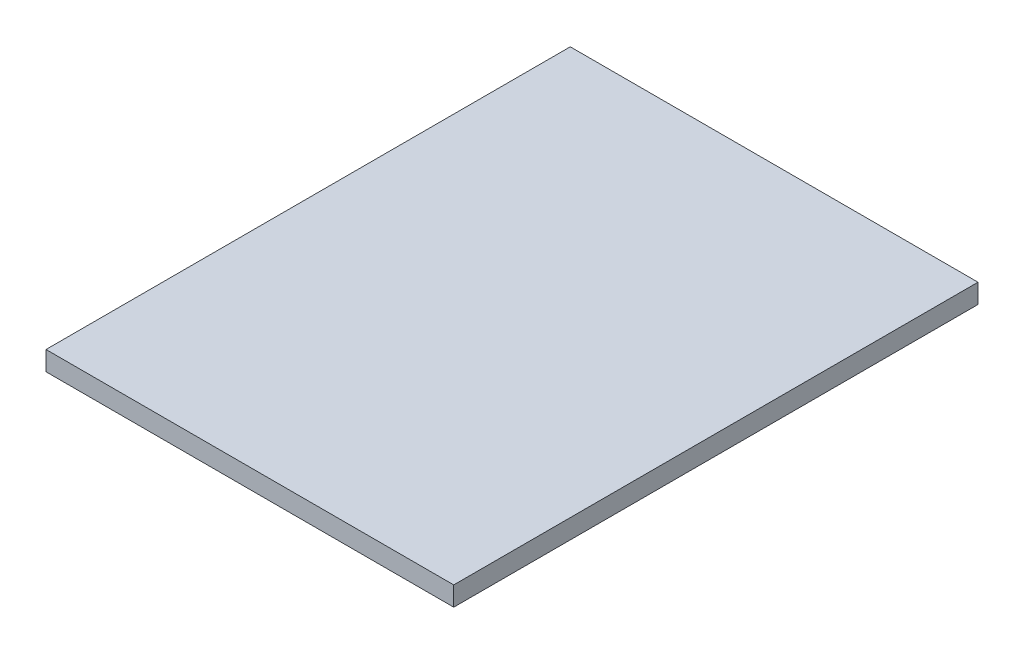
ISO-10303-21;
HEADER;
FILE_DESCRIPTION(('STEP AP214'),'2;1');
FILE_NAME('part.step','',(''),(''),'','','');
FILE_SCHEMA(('AUTOMOTIVE_DESIGN { 1 0 10303 214 1 1 1 1 }'));
ENDSEC;
DATA;
#1=APPLICATION_CONTEXT('core data for automotive mechanical design processes');
#2=APPLICATION_PROTOCOL_DEFINITION('international standard','automotive_design',2000,#1);
#3=PRODUCT_CONTEXT('',#1,'mechanical');
#4=PRODUCT('Part','Part','',(#3));
#5=PRODUCT_RELATED_PRODUCT_CATEGORY('part','',(#4));
#6=PRODUCT_DEFINITION_FORMATION('','',#4);
#7=PRODUCT_DEFINITION_CONTEXT('part definition',#1,'design');
#8=PRODUCT_DEFINITION('design','',#6,#7);
#9=PRODUCT_DEFINITION_SHAPE('','',#8);
#10=(LENGTH_UNIT() NAMED_UNIT(*) SI_UNIT(.MILLI.,.METRE.));
#11=(NAMED_UNIT(*) PLANE_ANGLE_UNIT() SI_UNIT($,.RADIAN.));
#12=(NAMED_UNIT(*) SI_UNIT($,.STERADIAN.) SOLID_ANGLE_UNIT());
#13=UNCERTAINTY_MEASURE_WITH_UNIT(LENGTH_MEASURE(1.E-05),#10,'distance_accuracy_value','');
#14=(GEOMETRIC_REPRESENTATION_CONTEXT(3) GLOBAL_UNCERTAINTY_ASSIGNED_CONTEXT((#13)) GLOBAL_UNIT_ASSIGNED_CONTEXT((#10,
#11,#12)) REPRESENTATION_CONTEXT('',''));
#15=CARTESIAN_POINT('',(0.,0.,0.));
#16=DIRECTION('',(0.,0.,1.));
#17=DIRECTION('',(1.,0.,0.));
#18=AXIS2_PLACEMENT_3D('',#15,#16,#17);
#19=CARTESIAN_POINT('',(0.,2.54,0.));
#20=DIRECTION('',(1.,0.,0.));
#21=DIRECTION('',(0.,0.,-1.));
#22=AXIS2_PLACEMENT_3D('',#19,#20,#21);
#23=PLANE('',#22);
#24=DIRECTION('',(0.,0.,1.));
#25=VECTOR('',#24,1.);
#26=CARTESIAN_POINT('',(0.,0.,0.));
#27=LINE('',#26,#25);
#28=CARTESIAN_POINT('',(0.,0.,-68.9102));
#29=VERTEX_POINT('',#28);
#30=CARTESIAN_POINT('',(0.,0.,0.));
#31=VERTEX_POINT('',#30);
#32=EDGE_CURVE('E96',#29,#31,#27,.T.);
#33=ORIENTED_EDGE('',*,*,#32,.T.);
#34=DIRECTION('',(0.,-1.,0.));
#35=VECTOR('',#34,1.);
#36=CARTESIAN_POINT('',(0.,2.54,0.));
#37=LINE('',#36,#35);
#38=CARTESIAN_POINT('',(0.,2.54,0.));
#39=VERTEX_POINT('',#38);
#40=EDGE_CURVE('E11',#39,#31,#37,.T.);
#41=ORIENTED_EDGE('',*,*,#40,.F.);
#42=DIRECTION('',(0.,0.,1.));
#43=VECTOR('',#42,1.);
#44=CARTESIAN_POINT('',(0.,2.54,0.));
#45=LINE('',#44,#43);
#46=CARTESIAN_POINT('',(0.,2.54,-68.9102));
#47=VERTEX_POINT('',#46);
#48=EDGE_CURVE('E84',#47,#39,#45,.T.);
#49=ORIENTED_EDGE('',*,*,#48,.F.);
#50=DIRECTION('',(0.,-1.,0.));
#51=VECTOR('',#50,1.);
#52=CARTESIAN_POINT('',(0.,2.54,-68.9102));
#53=LINE('',#52,#51);
#54=EDGE_CURVE('E92',#47,#29,#53,.T.);
#55=ORIENTED_EDGE('',*,*,#54,.T.);
#56=EDGE_LOOP('',(#33,#41,#49,#55));
#57=FACE_BOUND('',#56,.T.);
#58=ADVANCED_FACE('F33',(#57),#23,.F.);
#59=CARTESIAN_POINT('',(0.,2.54,0.));
#60=DIRECTION('',(0.,0.,-1.));
#61=DIRECTION('',(-1.,0.,0.));
#62=AXIS2_PLACEMENT_3D('',#59,#60,#61);
#63=PLANE('',#62);
#64=DIRECTION('',(1.,0.,0.));
#65=VECTOR('',#64,1.);
#66=CARTESIAN_POINT('',(0.,0.,0.));
#67=LINE('',#66,#65);
#68=CARTESIAN_POINT('',(53.594,0.,0.));
#69=VERTEX_POINT('',#68);
#70=EDGE_CURVE('E88',#31,#69,#67,.T.);
#71=ORIENTED_EDGE('',*,*,#70,.T.);
#72=DIRECTION('',(0.,-1.,0.));
#73=VECTOR('',#72,1.);
#74=CARTESIAN_POINT('',(53.594,2.54,0.));
#75=LINE('',#74,#73);
#76=CARTESIAN_POINT('',(53.594,2.54,0.));
#77=VERTEX_POINT('',#76);
#78=EDGE_CURVE('E41',#77,#69,#75,.T.);
#79=ORIENTED_EDGE('',*,*,#78,.F.);
#80=DIRECTION('',(1.,0.,0.));
#81=VECTOR('',#80,1.);
#82=CARTESIAN_POINT('',(0.,2.54,0.));
#83=LINE('',#82,#81);
#84=EDGE_CURVE('E79',#39,#77,#83,.T.);
#85=ORIENTED_EDGE('',*,*,#84,.F.);
#86=ORIENTED_EDGE('',*,*,#40,.T.);
#87=EDGE_LOOP('',(#71,#79,#85,#86));
#88=FACE_BOUND('',#87,.T.);
#89=ADVANCED_FACE('F87',(#88),#63,.F.);
#90=CARTESIAN_POINT('',(53.594,2.54,0.));
#91=DIRECTION('',(-1.,0.,0.));
#92=DIRECTION('',(0.,0.,1.));
#93=AXIS2_PLACEMENT_3D('',#90,#91,#92);
#94=PLANE('',#93);
#95=DIRECTION('',(0.,0.,-1.));
#96=VECTOR('',#95,1.);
#97=CARTESIAN_POINT('',(53.594,0.,0.));
#98=LINE('',#97,#96);
#99=CARTESIAN_POINT('',(53.594,0.,-68.9102));
#100=VERTEX_POINT('',#99);
#101=EDGE_CURVE('E66',#69,#100,#98,.T.);
#102=ORIENTED_EDGE('',*,*,#101,.T.);
#103=DIRECTION('',(0.,-1.,0.));
#104=VECTOR('',#103,1.);
#105=CARTESIAN_POINT('',(53.594,2.54,-68.9102));
#106=LINE('',#105,#104);
#107=CARTESIAN_POINT('',(53.594,2.54,-68.9102));
#108=VERTEX_POINT('',#107);
#109=EDGE_CURVE('E89',#108,#100,#106,.T.);
#110=ORIENTED_EDGE('',*,*,#109,.F.);
#111=DIRECTION('',(0.,0.,-1.));
#112=VECTOR('',#111,1.);
#113=CARTESIAN_POINT('',(53.594,2.54,0.));
#114=LINE('',#113,#112);
#115=EDGE_CURVE('E82',#77,#108,#114,.T.);
#116=ORIENTED_EDGE('',*,*,#115,.F.);
#117=ORIENTED_EDGE('',*,*,#78,.T.);
#118=EDGE_LOOP('',(#102,#110,#116,#117));
#119=FACE_BOUND('',#118,.T.);
#120=ADVANCED_FACE('F90',(#119),#94,.F.);
#121=CARTESIAN_POINT('',(0.,2.54,-68.9102));
#122=DIRECTION('',(0.,0.,1.));
#123=DIRECTION('',(1.,0.,0.));
#124=AXIS2_PLACEMENT_3D('',#121,#122,#123);
#125=PLANE('',#124);
#126=DIRECTION('',(-1.,0.,0.));
#127=VECTOR('',#126,1.);
#128=CARTESIAN_POINT('',(0.,0.,-68.9102));
#129=LINE('',#128,#127);
#130=EDGE_CURVE('E72',#100,#29,#129,.T.);
#131=ORIENTED_EDGE('',*,*,#130,.T.);
#132=ORIENTED_EDGE('',*,*,#54,.F.);
#133=DIRECTION('',(-1.,0.,0.));
#134=VECTOR('',#133,1.);
#135=CARTESIAN_POINT('',(0.,2.54,-68.9102));
#136=LINE('',#135,#134);
#137=EDGE_CURVE('E49',#108,#47,#136,.T.);
#138=ORIENTED_EDGE('',*,*,#137,.F.);
#139=ORIENTED_EDGE('',*,*,#109,.T.);
#140=EDGE_LOOP('',(#131,#132,#138,#139));
#141=FACE_BOUND('',#140,.T.);
#142=ADVANCED_FACE('F103',(#141),#125,.F.);
#143=CARTESIAN_POINT('',(0.,2.54,0.));
#144=DIRECTION('',(0.,-1.,0.));
#145=DIRECTION('',(0.,0.,-1.));
#146=AXIS2_PLACEMENT_3D('',#143,#144,#145);
#147=PLANE('',#146);
#148=ORIENTED_EDGE('',*,*,#48,.T.);
#149=ORIENTED_EDGE('',*,*,#84,.T.);
#150=ORIENTED_EDGE('',*,*,#115,.T.);
#151=ORIENTED_EDGE('',*,*,#137,.T.);
#152=EDGE_LOOP('',(#148,#149,#150,#151));
#153=FACE_BOUND('',#152,.T.);
#154=ADVANCED_FACE('F80',(#153),#147,.F.);
#155=CARTESIAN_POINT('',(0.,0.,0.));
#156=DIRECTION('',(0.,-1.,0.));
#157=DIRECTION('',(0.,0.,-1.));
#158=AXIS2_PLACEMENT_3D('',#155,#156,#157);
#159=PLANE('',#158);
#160=ORIENTED_EDGE('',*,*,#32,.F.);
#161=ORIENTED_EDGE('',*,*,#130,.F.);
#162=ORIENTED_EDGE('',*,*,#101,.F.);
#163=ORIENTED_EDGE('',*,*,#70,.F.);
#164=EDGE_LOOP('',(#160,#161,#162,#163));
#165=FACE_BOUND('',#164,.T.);
#166=ADVANCED_FACE('F106',(#165),#159,.T.);
#167=CLOSED_SHELL('',(#58,#89,#120,#142,#154,#166));
#168=MANIFOLD_SOLID_BREP('B2',#167);
#169=ADVANCED_BREP_SHAPE_REPRESENTATION('',(#18,#168),#14);
#170=SHAPE_DEFINITION_REPRESENTATION(#9,#169);
ENDSEC;
END-ISO-10303-21;
